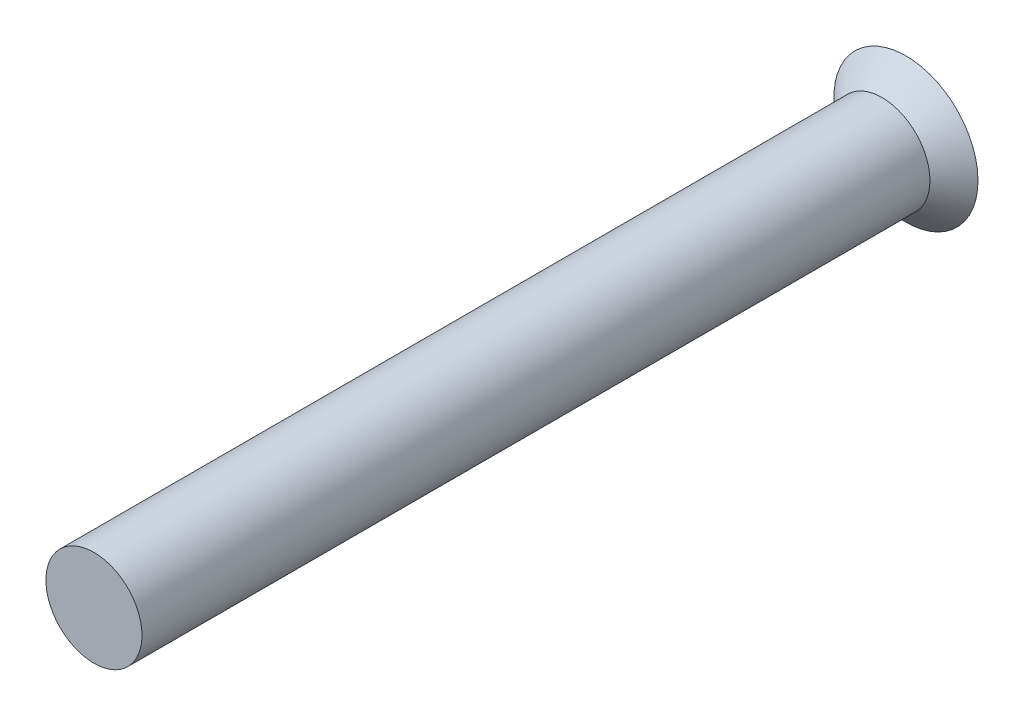
ISO-10303-21;
HEADER;
FILE_DESCRIPTION(('STEP AP214'),'2;1');
FILE_NAME('part.step','',(''),(''),'','','');
FILE_SCHEMA(('AUTOMOTIVE_DESIGN { 1 0 10303 214 1 1 1 1 }'));
ENDSEC;
DATA;
#1=APPLICATION_CONTEXT('core data for automotive mechanical design processes');
#2=APPLICATION_PROTOCOL_DEFINITION('international standard','automotive_design',2000,#1);
#3=PRODUCT_CONTEXT('',#1,'mechanical');
#4=PRODUCT('Part','Part','',(#3));
#5=PRODUCT_RELATED_PRODUCT_CATEGORY('part','',(#4));
#6=PRODUCT_DEFINITION_FORMATION('','',#4);
#7=PRODUCT_DEFINITION_CONTEXT('part definition',#1,'design');
#8=PRODUCT_DEFINITION('design','',#6,#7);
#9=PRODUCT_DEFINITION_SHAPE('','',#8);
#10=(LENGTH_UNIT() NAMED_UNIT(*) SI_UNIT(.MILLI.,.METRE.));
#11=(NAMED_UNIT(*) PLANE_ANGLE_UNIT() SI_UNIT($,.RADIAN.));
#12=(NAMED_UNIT(*) SI_UNIT($,.STERADIAN.) SOLID_ANGLE_UNIT());
#13=UNCERTAINTY_MEASURE_WITH_UNIT(LENGTH_MEASURE(1.E-05),#10,'distance_accuracy_value','');
#14=(GEOMETRIC_REPRESENTATION_CONTEXT(3) GLOBAL_UNCERTAINTY_ASSIGNED_CONTEXT((#13)) GLOBAL_UNIT_ASSIGNED_CONTEXT((#10,
#11,#12)) REPRESENTATION_CONTEXT('',''));
#15=CARTESIAN_POINT('',(0.,0.,0.));
#16=DIRECTION('',(0.,0.,1.));
#17=DIRECTION('',(1.,0.,0.));
#18=AXIS2_PLACEMENT_3D('',#15,#16,#17);
#19=CARTESIAN_POINT('',(0.,0.,4.1));
#20=DIRECTION('',(0.,0.,-1.));
#21=DIRECTION('',(-1.,0.,0.));
#22=AXIS2_PLACEMENT_3D('',#19,#20,#21);
#23=CYLINDRICAL_SURFACE('',#22,0.5);
#24=CARTESIAN_POINT('',(0.,0.,4.1));
#25=DIRECTION('',(0.,0.,1.));
#26=DIRECTION('',(1.,0.,0.));
#27=AXIS2_PLACEMENT_3D('',#24,#25,#26);
#28=CIRCLE('',#27,0.5);
#29=CARTESIAN_POINT('',(0.5,0.,4.1));
#30=VERTEX_POINT('',#29);
#31=EDGE_CURVE('E11',#30,#30,#28,.T.);
#32=ORIENTED_EDGE('',*,*,#31,.F.);
#33=EDGE_LOOP('',(#32));
#34=FACE_BOUND('',#33,.T.);
#35=CARTESIAN_POINT('',(0.,0.,-4.1));
#36=DIRECTION('',(0.,0.,1.));
#37=DIRECTION('',(1.,0.,0.));
#38=AXIS2_PLACEMENT_3D('',#35,#36,#37);
#39=CIRCLE('',#38,0.5);
#40=CARTESIAN_POINT('',(0.5,0.,-4.1));
#41=VERTEX_POINT('',#40);
#42=EDGE_CURVE('E190',#41,#41,#39,.T.);
#43=ORIENTED_EDGE('',*,*,#42,.T.);
#44=EDGE_LOOP('',(#43));
#45=FACE_BOUND('',#44,.T.);
#46=ADVANCED_FACE('F35',(#34,#45),#23,.T.);
#47=CARTESIAN_POINT('',(0.,0.,4.1));
#48=DIRECTION('',(0.,0.,1.));
#49=DIRECTION('',(1.,0.,0.));
#50=AXIS2_PLACEMENT_3D('',#47,#48,#49);
#51=PLANE('',#50);
#52=ORIENTED_EDGE('',*,*,#31,.T.);
#53=EDGE_LOOP('',(#52));
#54=FACE_BOUND('',#53,.T.);
#55=ADVANCED_FACE('F225',(#54),#51,.T.);
#56=CARTESIAN_POINT('',(0.,0.,-4.35));
#57=DIRECTION('',(0.,0.,-1.));
#58=DIRECTION('',(-1.,0.,0.));
#59=AXIS2_PLACEMENT_3D('',#56,#57,#58);
#60=CONICAL_SURFACE('',#59,0.750000000000001,0.78539816339745);
#61=ORIENTED_EDGE('',*,*,#42,.F.);
#62=EDGE_LOOP('',(#61));
#63=FACE_BOUND('',#62,.T.);
#64=CARTESIAN_POINT('',(0.,0.,-4.35));
#65=DIRECTION('',(0.,0.,1.));
#66=DIRECTION('',(1.,0.,0.));
#67=AXIS2_PLACEMENT_3D('',#64,#65,#66);
#68=CIRCLE('',#67,0.750000000000001);
#69=CARTESIAN_POINT('',(0.750000000000001,0.,-4.35));
#70=VERTEX_POINT('',#69);
#71=EDGE_CURVE('E42',#70,#70,#68,.T.);
#72=ORIENTED_EDGE('',*,*,#71,.T.);
#73=EDGE_LOOP('',(#72));
#74=FACE_BOUND('',#73,.T.);
#75=ADVANCED_FACE('F212',(#63,#74),#60,.T.);
#76=CARTESIAN_POINT('',(0.,0.750000000000001,-4.35));
#77=DIRECTION('',(0.,0.,1.));
#78=DIRECTION('',(1.,0.,0.));
#79=AXIS2_PLACEMENT_3D('',#76,#77,#78);
#80=PLANE('',#79);
#81=DIRECTION('',(1.,0.,0.));
#82=VECTOR('',#81,1.);
#83=CARTESIAN_POINT('',(-0.1,0.6,-4.35));
#84=LINE('',#83,#82);
#85=CARTESIAN_POINT('',(-0.1,0.6,-4.35));
#86=VERTEX_POINT('',#85);
#87=CARTESIAN_POINT('',(0.0999999999999999,0.6,-4.35));
#88=VERTEX_POINT('',#87);
#89=EDGE_CURVE('E159',#86,#88,#84,.T.);
#90=ORIENTED_EDGE('',*,*,#89,.F.);
#91=DIRECTION('',(0.,1.,0.));
#92=VECTOR('',#91,1.);
#93=CARTESIAN_POINT('',(-0.1,0.1,-4.35));
#94=LINE('',#93,#92);
#95=CARTESIAN_POINT('',(-0.1,0.1,-4.35));
#96=VERTEX_POINT('',#95);
#97=EDGE_CURVE('E49',#96,#86,#94,.T.);
#98=ORIENTED_EDGE('',*,*,#97,.F.);
#99=DIRECTION('',(1.,0.,0.));
#100=VECTOR('',#99,1.);
#101=CARTESIAN_POINT('',(-0.6,0.1,-4.35));
#102=LINE('',#101,#100);
#103=CARTESIAN_POINT('',(-0.6,0.1,-4.35));
#104=VERTEX_POINT('',#103);
#105=EDGE_CURVE('E186',#104,#96,#102,.T.);
#106=ORIENTED_EDGE('',*,*,#105,.F.);
#107=DIRECTION('',(0.,1.,0.));
#108=VECTOR('',#107,1.);
#109=CARTESIAN_POINT('',(-0.6,-0.1,-4.35));
#110=LINE('',#109,#108);
#111=CARTESIAN_POINT('',(-0.6,-0.1,-4.35));
#112=VERTEX_POINT('',#111);
#113=EDGE_CURVE('E184',#112,#104,#110,.T.);
#114=ORIENTED_EDGE('',*,*,#113,.F.);
#115=DIRECTION('',(-1.,0.,0.));
#116=VECTOR('',#115,1.);
#117=CARTESIAN_POINT('',(-0.105645493590678,-0.1,-4.35));
#118=LINE('',#117,#116);
#119=CARTESIAN_POINT('',(-0.105645493590678,-0.1,-4.35));
#120=VERTEX_POINT('',#119);
#121=EDGE_CURVE('E133',#120,#112,#118,.T.);
#122=ORIENTED_EDGE('',*,*,#121,.F.);
#123=DIRECTION('',(0.,1.,0.));
#124=VECTOR('',#123,1.);
#125=CARTESIAN_POINT('',(-0.105645493590678,-0.6,-4.35));
#126=LINE('',#125,#124);
#127=CARTESIAN_POINT('',(-0.105645493590678,-0.6,-4.35));
#128=VERTEX_POINT('',#127);
#129=EDGE_CURVE('E180',#128,#120,#126,.T.);
#130=ORIENTED_EDGE('',*,*,#129,.F.);
#131=DIRECTION('',(-1.,0.,0.));
#132=VECTOR('',#131,1.);
#133=CARTESIAN_POINT('',(0.105645493590678,-0.6,-4.35));
#134=LINE('',#133,#132);
#135=CARTESIAN_POINT('',(0.105645493590678,-0.6,-4.35));
#136=VERTEX_POINT('',#135);
#137=EDGE_CURVE('E177',#136,#128,#134,.T.);
#138=ORIENTED_EDGE('',*,*,#137,.F.);
#139=DIRECTION('',(0.,-1.,0.));
#140=VECTOR('',#139,1.);
#141=CARTESIAN_POINT('',(0.105645493590678,-0.1,-4.35));
#142=LINE('',#141,#140);
#143=CARTESIAN_POINT('',(0.105645493590678,-0.1,-4.35));
#144=VERTEX_POINT('',#143);
#145=EDGE_CURVE('E174',#144,#136,#142,.T.);
#146=ORIENTED_EDGE('',*,*,#145,.F.);
#147=DIRECTION('',(-1.,0.,0.));
#148=VECTOR('',#147,1.);
#149=CARTESIAN_POINT('',(0.6,-0.1,-4.35));
#150=LINE('',#149,#148);
#151=CARTESIAN_POINT('',(0.6,-0.1,-4.35));
#152=VERTEX_POINT('',#151);
#153=EDGE_CURVE('E171',#152,#144,#150,.T.);
#154=ORIENTED_EDGE('',*,*,#153,.F.);
#155=DIRECTION('',(0.,-1.,0.));
#156=VECTOR('',#155,1.);
#157=CARTESIAN_POINT('',(0.6,0.1,-4.35));
#158=LINE('',#157,#156);
#159=CARTESIAN_POINT('',(0.6,0.1,-4.35));
#160=VERTEX_POINT('',#159);
#161=EDGE_CURVE('E168',#160,#152,#158,.T.);
#162=ORIENTED_EDGE('',*,*,#161,.F.);
#163=DIRECTION('',(1.,0.,0.));
#164=VECTOR('',#163,1.);
#165=CARTESIAN_POINT('',(0.0999999999999999,0.1,-4.35));
#166=LINE('',#165,#164);
#167=CARTESIAN_POINT('',(0.0999999999999999,0.1,-4.35));
#168=VERTEX_POINT('',#167);
#169=EDGE_CURVE('E165',#168,#160,#166,.T.);
#170=ORIENTED_EDGE('',*,*,#169,.F.);
#171=DIRECTION('',(0.,-1.,0.));
#172=VECTOR('',#171,1.);
#173=CARTESIAN_POINT('',(0.0999999999999999,0.6,-4.35));
#174=LINE('',#173,#172);
#175=EDGE_CURVE('E162',#88,#168,#174,.T.);
#176=ORIENTED_EDGE('',*,*,#175,.F.);
#177=EDGE_LOOP('',(#90,#98,#106,#114,#122,#130,#138,#146,#154,#162,#170,#176));
#178=FACE_BOUND('',#177,.T.);
#179=ORIENTED_EDGE('',*,*,#71,.F.);
#180=EDGE_LOOP('',(#179));
#181=FACE_BOUND('',#180,.T.);
#182=ADVANCED_FACE('F214',(#178,#181),#80,.F.);
#183=CARTESIAN_POINT('',(-0.1,0.1,-4.25));
#184=DIRECTION('',(-1.,0.,0.));
#185=DIRECTION('',(0.,-1.,0.));
#186=AXIS2_PLACEMENT_3D('',#183,#184,#185);
#187=PLANE('',#186);
#188=ORIENTED_EDGE('',*,*,#97,.T.);
#189=DIRECTION('',(0.,0.,-1.));
#190=VECTOR('',#189,1.);
#191=CARTESIAN_POINT('',(-0.1,0.6,-4.25));
#192=LINE('',#191,#190);
#193=CARTESIAN_POINT('',(-0.1,0.6,-4.25));
#194=VERTEX_POINT('',#193);
#195=EDGE_CURVE('E97',#194,#86,#192,.T.);
#196=ORIENTED_EDGE('',*,*,#195,.F.);
#197=DIRECTION('',(0.,1.,0.));
#198=VECTOR('',#197,1.);
#199=CARTESIAN_POINT('',(-0.1,0.1,-4.25));
#200=LINE('',#199,#198);
#201=CARTESIAN_POINT('',(-0.1,0.1,-4.25));
#202=VERTEX_POINT('',#201);
#203=EDGE_CURVE('E188',#202,#194,#200,.T.);
#204=ORIENTED_EDGE('',*,*,#203,.F.);
#205=DIRECTION('',(0.,0.,-1.));
#206=VECTOR('',#205,1.);
#207=CARTESIAN_POINT('',(-0.1,0.1,-4.25));
#208=LINE('',#207,#206);
#209=EDGE_CURVE('E57',#202,#96,#208,.T.);
#210=ORIENTED_EDGE('',*,*,#209,.T.);
#211=EDGE_LOOP('',(#188,#196,#204,#210));
#212=FACE_BOUND('',#211,.T.);
#213=ADVANCED_FACE('F216',(#212),#187,.F.);
#214=CARTESIAN_POINT('',(-0.6,0.1,-4.25));
#215=DIRECTION('',(0.,1.,0.));
#216=DIRECTION('',(-1.,0.,0.));
#217=AXIS2_PLACEMENT_3D('',#214,#215,#216);
#218=PLANE('',#217);
#219=ORIENTED_EDGE('',*,*,#105,.T.);
#220=ORIENTED_EDGE('',*,*,#209,.F.);
#221=DIRECTION('',(1.,0.,0.));
#222=VECTOR('',#221,1.);
#223=CARTESIAN_POINT('',(-0.6,0.1,-4.25));
#224=LINE('',#223,#222);
#225=CARTESIAN_POINT('',(-0.6,0.1,-4.25));
#226=VERTEX_POINT('',#225);
#227=EDGE_CURVE('E145',#226,#202,#224,.T.);
#228=ORIENTED_EDGE('',*,*,#227,.F.);
#229=DIRECTION('',(0.,0.,-1.));
#230=VECTOR('',#229,1.);
#231=CARTESIAN_POINT('',(-0.6,0.1,-4.25));
#232=LINE('',#231,#230);
#233=EDGE_CURVE('E137',#226,#104,#232,.T.);
#234=ORIENTED_EDGE('',*,*,#233,.T.);
#235=EDGE_LOOP('',(#219,#220,#228,#234));
#236=FACE_BOUND('',#235,.T.);
#237=ADVANCED_FACE('F223',(#236),#218,.F.);
#238=CARTESIAN_POINT('',(-0.6,-0.1,-4.25));
#239=DIRECTION('',(-1.,0.,0.));
#240=DIRECTION('',(0.,-1.,0.));
#241=AXIS2_PLACEMENT_3D('',#238,#239,#240);
#242=PLANE('',#241);
#243=ORIENTED_EDGE('',*,*,#113,.T.);
#244=ORIENTED_EDGE('',*,*,#233,.F.);
#245=DIRECTION('',(0.,1.,0.));
#246=VECTOR('',#245,1.);
#247=CARTESIAN_POINT('',(-0.6,-0.1,-4.25));
#248=LINE('',#247,#246);
#249=CARTESIAN_POINT('',(-0.6,-0.1,-4.25));
#250=VERTEX_POINT('',#249);
#251=EDGE_CURVE('E141',#250,#226,#248,.T.);
#252=ORIENTED_EDGE('',*,*,#251,.F.);
#253=DIRECTION('',(0.,0.,-1.));
#254=VECTOR('',#253,1.);
#255=CARTESIAN_POINT('',(-0.6,-0.1,-4.25));
#256=LINE('',#255,#254);
#257=EDGE_CURVE('E126',#250,#112,#256,.T.);
#258=ORIENTED_EDGE('',*,*,#257,.T.);
#259=EDGE_LOOP('',(#243,#244,#252,#258));
#260=FACE_BOUND('',#259,.T.);
#261=ADVANCED_FACE('F142',(#260),#242,.F.);
#262=CARTESIAN_POINT('',(-0.105645493590678,-0.1,-4.25));
#263=DIRECTION('',(0.,-1.,0.));
#264=DIRECTION('',(1.,0.,0.));
#265=AXIS2_PLACEMENT_3D('',#262,#263,#264);
#266=PLANE('',#265);
#267=ORIENTED_EDGE('',*,*,#121,.T.);
#268=ORIENTED_EDGE('',*,*,#257,.F.);
#269=DIRECTION('',(-1.,0.,0.));
#270=VECTOR('',#269,1.);
#271=CARTESIAN_POINT('',(-0.105645493590678,-0.1,-4.25));
#272=LINE('',#271,#270);
#273=CARTESIAN_POINT('',(-0.105645493590678,-0.1,-4.25));
#274=VERTEX_POINT('',#273);
#275=EDGE_CURVE('E130',#274,#250,#272,.T.);
#276=ORIENTED_EDGE('',*,*,#275,.F.);
#277=DIRECTION('',(0.,0.,-1.));
#278=VECTOR('',#277,1.);
#279=CARTESIAN_POINT('',(-0.105645493590678,-0.1,-4.25));
#280=LINE('',#279,#278);
#281=EDGE_CURVE('E138',#274,#120,#280,.T.);
#282=ORIENTED_EDGE('',*,*,#281,.T.);
#283=EDGE_LOOP('',(#267,#268,#276,#282));
#284=FACE_BOUND('',#283,.T.);
#285=ADVANCED_FACE('F128',(#284),#266,.F.);
#286=CARTESIAN_POINT('',(-0.105645493590678,-0.6,-4.25));
#287=DIRECTION('',(-1.,0.,0.));
#288=DIRECTION('',(0.,0.,1.));
#289=AXIS2_PLACEMENT_3D('',#286,#287,#288);
#290=PLANE('',#289);
#291=ORIENTED_EDGE('',*,*,#129,.T.);
#292=ORIENTED_EDGE('',*,*,#281,.F.);
#293=DIRECTION('',(0.,1.,0.));
#294=VECTOR('',#293,1.);
#295=CARTESIAN_POINT('',(-0.105645493590678,-0.6,-4.25));
#296=LINE('',#295,#294);
#297=CARTESIAN_POINT('',(-0.105645493590678,-0.6,-4.25));
#298=VERTEX_POINT('',#297);
#299=EDGE_CURVE('E151',#298,#274,#296,.T.);
#300=ORIENTED_EDGE('',*,*,#299,.F.);
#301=DIRECTION('',(0.,0.,-1.));
#302=VECTOR('',#301,1.);
#303=CARTESIAN_POINT('',(-0.105645493590678,-0.6,-4.25));
#304=LINE('',#303,#302);
#305=EDGE_CURVE('E193',#298,#128,#304,.T.);
#306=ORIENTED_EDGE('',*,*,#305,.T.);
#307=EDGE_LOOP('',(#291,#292,#300,#306));
#308=FACE_BOUND('',#307,.T.);
#309=ADVANCED_FACE('F279',(#308),#290,.F.);
#310=CARTESIAN_POINT('',(0.105645493590678,-0.6,-4.25));
#311=DIRECTION('',(0.,-1.,0.));
#312=DIRECTION('',(0.,0.,-1.));
#313=AXIS2_PLACEMENT_3D('',#310,#311,#312);
#314=PLANE('',#313);
#315=ORIENTED_EDGE('',*,*,#137,.T.);
#316=ORIENTED_EDGE('',*,*,#305,.F.);
#317=DIRECTION('',(-1.,0.,0.));
#318=VECTOR('',#317,1.);
#319=CARTESIAN_POINT('',(0.105645493590678,-0.6,-4.25));
#320=LINE('',#319,#318);
#321=CARTESIAN_POINT('',(0.105645493590678,-0.6,-4.25));
#322=VERTEX_POINT('',#321);
#323=EDGE_CURVE('E153',#322,#298,#320,.T.);
#324=ORIENTED_EDGE('',*,*,#323,.F.);
#325=DIRECTION('',(0.,0.,-1.));
#326=VECTOR('',#325,1.);
#327=CARTESIAN_POINT('',(0.105645493590678,-0.6,-4.25));
#328=LINE('',#327,#326);
#329=EDGE_CURVE('E195',#322,#136,#328,.T.);
#330=ORIENTED_EDGE('',*,*,#329,.T.);
#331=EDGE_LOOP('',(#315,#316,#324,#330));
#332=FACE_BOUND('',#331,.T.);
#333=ADVANCED_FACE('F288',(#332),#314,.F.);
#334=CARTESIAN_POINT('',(0.105645493590678,-0.1,-4.25));
#335=DIRECTION('',(1.,0.,0.));
#336=DIRECTION('',(0.,0.,-1.));
#337=AXIS2_PLACEMENT_3D('',#334,#335,#336);
#338=PLANE('',#337);
#339=ORIENTED_EDGE('',*,*,#145,.T.);
#340=ORIENTED_EDGE('',*,*,#329,.F.);
#341=DIRECTION('',(0.,-1.,0.));
#342=VECTOR('',#341,1.);
#343=CARTESIAN_POINT('',(0.105645493590678,-0.1,-4.25));
#344=LINE('',#343,#342);
#345=CARTESIAN_POINT('',(0.105645493590678,-0.1,-4.25));
#346=VERTEX_POINT('',#345);
#347=EDGE_CURVE('E392',#346,#322,#344,.T.);
#348=ORIENTED_EDGE('',*,*,#347,.F.);
#349=DIRECTION('',(0.,0.,-1.));
#350=VECTOR('',#349,1.);
#351=CARTESIAN_POINT('',(0.105645493590678,-0.1,-4.25));
#352=LINE('',#351,#350);
#353=EDGE_CURVE('E197',#346,#144,#352,.T.);
#354=ORIENTED_EDGE('',*,*,#353,.T.);
#355=EDGE_LOOP('',(#339,#340,#348,#354));
#356=FACE_BOUND('',#355,.T.);
#357=ADVANCED_FACE('F298',(#356),#338,.F.);
#358=CARTESIAN_POINT('',(0.6,-0.1,-4.25));
#359=DIRECTION('',(0.,-1.,0.));
#360=DIRECTION('',(1.,0.,0.));
#361=AXIS2_PLACEMENT_3D('',#358,#359,#360);
#362=PLANE('',#361);
#363=ORIENTED_EDGE('',*,*,#153,.T.);
#364=ORIENTED_EDGE('',*,*,#353,.F.);
#365=DIRECTION('',(-1.,0.,0.));
#366=VECTOR('',#365,1.);
#367=CARTESIAN_POINT('',(0.6,-0.1,-4.25));
#368=LINE('',#367,#366);
#369=CARTESIAN_POINT('',(0.6,-0.1,-4.25));
#370=VERTEX_POINT('',#369);
#371=EDGE_CURVE('E389',#370,#346,#368,.T.);
#372=ORIENTED_EDGE('',*,*,#371,.F.);
#373=DIRECTION('',(0.,0.,-1.));
#374=VECTOR('',#373,1.);
#375=CARTESIAN_POINT('',(0.6,-0.1,-4.25));
#376=LINE('',#375,#374);
#377=EDGE_CURVE('E199',#370,#152,#376,.T.);
#378=ORIENTED_EDGE('',*,*,#377,.T.);
#379=EDGE_LOOP('',(#363,#364,#372,#378));
#380=FACE_BOUND('',#379,.T.);
#381=ADVANCED_FACE('F308',(#380),#362,.F.);
#382=CARTESIAN_POINT('',(0.6,0.1,-4.25));
#383=DIRECTION('',(1.,0.,0.));
#384=DIRECTION('',(0.,1.,0.));
#385=AXIS2_PLACEMENT_3D('',#382,#383,#384);
#386=PLANE('',#385);
#387=ORIENTED_EDGE('',*,*,#161,.T.);
#388=ORIENTED_EDGE('',*,*,#377,.F.);
#389=DIRECTION('',(0.,-1.,0.));
#390=VECTOR('',#389,1.);
#391=CARTESIAN_POINT('',(0.6,0.1,-4.25));
#392=LINE('',#391,#390);
#393=CARTESIAN_POINT('',(0.6,0.1,-4.25));
#394=VERTEX_POINT('',#393);
#395=EDGE_CURVE('E386',#394,#370,#392,.T.);
#396=ORIENTED_EDGE('',*,*,#395,.F.);
#397=DIRECTION('',(0.,0.,-1.));
#398=VECTOR('',#397,1.);
#399=CARTESIAN_POINT('',(0.6,0.1,-4.25));
#400=LINE('',#399,#398);
#401=EDGE_CURVE('E201',#394,#160,#400,.T.);
#402=ORIENTED_EDGE('',*,*,#401,.T.);
#403=EDGE_LOOP('',(#387,#388,#396,#402));
#404=FACE_BOUND('',#403,.T.);
#405=ADVANCED_FACE('F318',(#404),#386,.F.);
#406=CARTESIAN_POINT('',(0.0999999999999999,0.1,-4.25));
#407=DIRECTION('',(0.,1.,0.));
#408=DIRECTION('',(-1.,0.,0.));
#409=AXIS2_PLACEMENT_3D('',#406,#407,#408);
#410=PLANE('',#409);
#411=ORIENTED_EDGE('',*,*,#169,.T.);
#412=ORIENTED_EDGE('',*,*,#401,.F.);
#413=DIRECTION('',(1.,0.,0.));
#414=VECTOR('',#413,1.);
#415=CARTESIAN_POINT('',(0.0999999999999999,0.1,-4.25));
#416=LINE('',#415,#414);
#417=CARTESIAN_POINT('',(0.0999999999999999,0.1,-4.25));
#418=VERTEX_POINT('',#417);
#419=EDGE_CURVE('E379',#418,#394,#416,.T.);
#420=ORIENTED_EDGE('',*,*,#419,.F.);
#421=DIRECTION('',(0.,0.,-1.));
#422=VECTOR('',#421,1.);
#423=CARTESIAN_POINT('',(0.0999999999999999,0.1,-4.25));
#424=LINE('',#423,#422);
#425=EDGE_CURVE('E203',#418,#168,#424,.T.);
#426=ORIENTED_EDGE('',*,*,#425,.T.);
#427=EDGE_LOOP('',(#411,#412,#420,#426));
#428=FACE_BOUND('',#427,.T.);
#429=ADVANCED_FACE('F328',(#428),#410,.F.);
#430=CARTESIAN_POINT('',(0.0999999999999999,0.6,-4.25));
#431=DIRECTION('',(1.,0.,0.));
#432=DIRECTION('',(0.,0.,-1.));
#433=AXIS2_PLACEMENT_3D('',#430,#431,#432);
#434=PLANE('',#433);
#435=ORIENTED_EDGE('',*,*,#175,.T.);
#436=ORIENTED_EDGE('',*,*,#425,.F.);
#437=DIRECTION('',(0.,-1.,0.));
#438=VECTOR('',#437,1.);
#439=CARTESIAN_POINT('',(0.0999999999999999,0.6,-4.25));
#440=LINE('',#439,#438);
#441=CARTESIAN_POINT('',(0.0999999999999999,0.6,-4.25));
#442=VERTEX_POINT('',#441);
#443=EDGE_CURVE('E376',#442,#418,#440,.T.);
#444=ORIENTED_EDGE('',*,*,#443,.F.);
#445=DIRECTION('',(0.,0.,-1.));
#446=VECTOR('',#445,1.);
#447=CARTESIAN_POINT('',(0.0999999999999999,0.6,-4.25));
#448=LINE('',#447,#446);
#449=EDGE_CURVE('E205',#442,#88,#448,.T.);
#450=ORIENTED_EDGE('',*,*,#449,.T.);
#451=EDGE_LOOP('',(#435,#436,#444,#450));
#452=FACE_BOUND('',#451,.T.);
#453=ADVANCED_FACE('F338',(#452),#434,.F.);
#454=CARTESIAN_POINT('',(-0.1,0.6,-4.25));
#455=DIRECTION('',(0.,1.,0.));
#456=DIRECTION('',(0.,0.,1.));
#457=AXIS2_PLACEMENT_3D('',#454,#455,#456);
#458=PLANE('',#457);
#459=ORIENTED_EDGE('',*,*,#89,.T.);
#460=ORIENTED_EDGE('',*,*,#449,.F.);
#461=DIRECTION('',(1.,0.,0.));
#462=VECTOR('',#461,1.);
#463=CARTESIAN_POINT('',(-0.1,0.6,-4.25));
#464=LINE('',#463,#462);
#465=EDGE_CURVE('E380',#194,#442,#464,.T.);
#466=ORIENTED_EDGE('',*,*,#465,.F.);
#467=ORIENTED_EDGE('',*,*,#195,.T.);
#468=EDGE_LOOP('',(#459,#460,#466,#467));
#469=FACE_BOUND('',#468,.T.);
#470=ADVANCED_FACE('F348',(#469),#458,.F.);
#471=CARTESIAN_POINT('',(0.,0.,-4.25));
#472=DIRECTION('',(0.,0.,-1.));
#473=DIRECTION('',(-1.,0.,0.));
#474=AXIS2_PLACEMENT_3D('',#471,#472,#473);
#475=PLANE('',#474);
#476=ORIENTED_EDGE('',*,*,#203,.T.);
#477=ORIENTED_EDGE('',*,*,#465,.T.);
#478=ORIENTED_EDGE('',*,*,#443,.T.);
#479=ORIENTED_EDGE('',*,*,#419,.T.);
#480=ORIENTED_EDGE('',*,*,#395,.T.);
#481=ORIENTED_EDGE('',*,*,#371,.T.);
#482=ORIENTED_EDGE('',*,*,#347,.T.);
#483=ORIENTED_EDGE('',*,*,#323,.T.);
#484=ORIENTED_EDGE('',*,*,#299,.T.);
#485=ORIENTED_EDGE('',*,*,#275,.T.);
#486=ORIENTED_EDGE('',*,*,#251,.T.);
#487=ORIENTED_EDGE('',*,*,#227,.T.);
#488=EDGE_LOOP('',(#476,#477,#478,#479,#480,#481,#482,#483,#484,#485,#486,#487));
#489=FACE_BOUND('',#488,.T.);
#490=ADVANCED_FACE('F148',(#489),#475,.T.);
#491=CLOSED_SHELL('',(#46,#55,#75,#182,#213,#237,#261,#285,#309,#333,#357,#381,#405,#429,#453,
#470,#490));
#492=MANIFOLD_SOLID_BREP('B2',#491);
#493=ADVANCED_BREP_SHAPE_REPRESENTATION('',(#18,#492),#14);
#494=SHAPE_DEFINITION_REPRESENTATION(#9,#493);
ENDSEC;
END-ISO-10303-21;
